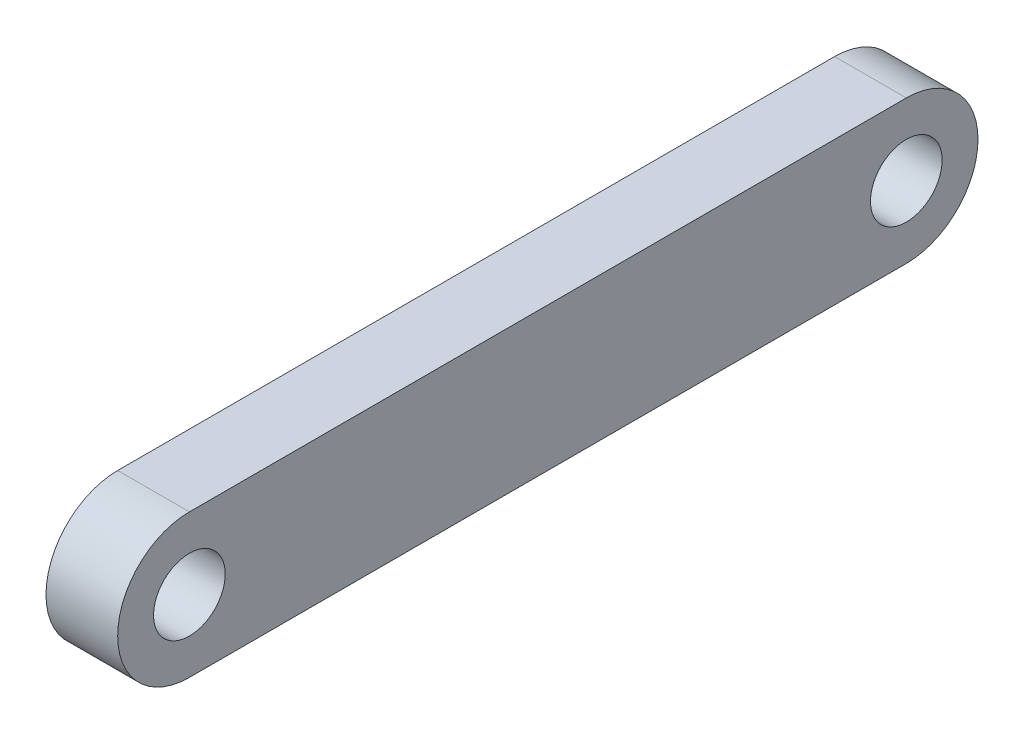
ISO-10303-21;
HEADER;
FILE_DESCRIPTION(('STEP AP214'),'2;1');
FILE_NAME('part.step','',(''),(''),'','','');
FILE_SCHEMA(('AUTOMOTIVE_DESIGN { 1 0 10303 214 1 1 1 1 }'));
ENDSEC;
DATA;
#1=APPLICATION_CONTEXT('core data for automotive mechanical design processes');
#2=APPLICATION_PROTOCOL_DEFINITION('international standard','automotive_design',2000,#1);
#3=PRODUCT_CONTEXT('',#1,'mechanical');
#4=PRODUCT('Part','Part','',(#3));
#5=PRODUCT_RELATED_PRODUCT_CATEGORY('part','',(#4));
#6=PRODUCT_DEFINITION_FORMATION('','',#4);
#7=PRODUCT_DEFINITION_CONTEXT('part definition',#1,'design');
#8=PRODUCT_DEFINITION('design','',#6,#7);
#9=PRODUCT_DEFINITION_SHAPE('','',#8);
#10=(LENGTH_UNIT() NAMED_UNIT(*) SI_UNIT(.MILLI.,.METRE.));
#11=(NAMED_UNIT(*) PLANE_ANGLE_UNIT() SI_UNIT($,.RADIAN.));
#12=(NAMED_UNIT(*) SI_UNIT($,.STERADIAN.) SOLID_ANGLE_UNIT());
#13=UNCERTAINTY_MEASURE_WITH_UNIT(LENGTH_MEASURE(1.E-05),#10,'distance_accuracy_value','');
#14=(GEOMETRIC_REPRESENTATION_CONTEXT(3) GLOBAL_UNCERTAINTY_ASSIGNED_CONTEXT((#13)) GLOBAL_UNIT_ASSIGNED_CONTEXT((#10,
#11,#12)) REPRESENTATION_CONTEXT('',''));
#15=CARTESIAN_POINT('',(0.,0.,0.));
#16=DIRECTION('',(0.,0.,1.));
#17=DIRECTION('',(1.,0.,0.));
#18=AXIS2_PLACEMENT_3D('',#15,#16,#17);
#19=CARTESIAN_POINT('',(8.,-7.99999999999999,0.));
#20=DIRECTION('',(0.,1.,0.));
#21=DIRECTION('',(0.,0.,1.));
#22=AXIS2_PLACEMENT_3D('',#19,#20,#21);
#23=PLANE('',#22);
#24=DIRECTION('',(0.,0.,-1.));
#25=VECTOR('',#24,1.);
#26=CARTESIAN_POINT('',(0.,-7.99999999999999,0.));
#27=LINE('',#26,#25);
#28=CARTESIAN_POINT('',(0.,-7.99999999999999,40.));
#29=VERTEX_POINT('',#28);
#30=CARTESIAN_POINT('',(0.,-7.99999999999999,-40.));
#31=VERTEX_POINT('',#30);
#32=EDGE_CURVE('E106',#29,#31,#27,.T.);
#33=ORIENTED_EDGE('',*,*,#32,.T.);
#34=DIRECTION('',(-1.,0.,0.));
#35=VECTOR('',#34,1.);
#36=CARTESIAN_POINT('',(8.,-7.99999999999999,-40.));
#37=LINE('',#36,#35);
#38=CARTESIAN_POINT('',(8.,-7.99999999999999,-40.));
#39=VERTEX_POINT('',#38);
#40=EDGE_CURVE('E11',#39,#31,#37,.T.);
#41=ORIENTED_EDGE('',*,*,#40,.F.);
#42=DIRECTION('',(0.,0.,-1.));
#43=VECTOR('',#42,1.);
#44=CARTESIAN_POINT('',(8.,-7.99999999999999,0.));
#45=LINE('',#44,#43);
#46=CARTESIAN_POINT('',(8.,-7.99999999999999,40.));
#47=VERTEX_POINT('',#46);
#48=EDGE_CURVE('E86',#47,#39,#45,.T.);
#49=ORIENTED_EDGE('',*,*,#48,.F.);
#50=DIRECTION('',(-1.,0.,0.));
#51=VECTOR('',#50,1.);
#52=CARTESIAN_POINT('',(8.,-7.99999999999999,40.));
#53=LINE('',#52,#51);
#54=EDGE_CURVE('E53',#47,#29,#53,.T.);
#55=ORIENTED_EDGE('',*,*,#54,.T.);
#56=EDGE_LOOP('',(#33,#41,#49,#55));
#57=FACE_BOUND('',#56,.T.);
#58=ADVANCED_FACE('F36',(#57),#23,.F.);
#59=CARTESIAN_POINT('',(8.,0.,-40.));
#60=DIRECTION('',(-1.,0.,0.));
#61=DIRECTION('',(0.,0.,1.));
#62=AXIS2_PLACEMENT_3D('',#59,#60,#61);
#63=CYLINDRICAL_SURFACE('',#62,7.99999999999999);
#64=CARTESIAN_POINT('',(0.,0.,-40.));
#65=DIRECTION('',(1.,0.,0.));
#66=DIRECTION('',(0.,0.,-1.));
#67=AXIS2_PLACEMENT_3D('',#64,#65,#66);
#68=CIRCLE('',#67,7.99999999999999);
#69=CARTESIAN_POINT('',(0.,7.99999999999998,-40.));
#70=VERTEX_POINT('',#69);
#71=EDGE_CURVE('E91',#31,#70,#68,.T.);
#72=ORIENTED_EDGE('',*,*,#71,.T.);
#73=DIRECTION('',(-1.,0.,0.));
#74=VECTOR('',#73,1.);
#75=CARTESIAN_POINT('',(8.,7.99999999999998,-40.));
#76=LINE('',#75,#74);
#77=CARTESIAN_POINT('',(8.,7.99999999999998,-40.));
#78=VERTEX_POINT('',#77);
#79=EDGE_CURVE('E45',#78,#70,#76,.T.);
#80=ORIENTED_EDGE('',*,*,#79,.F.);
#81=CARTESIAN_POINT('',(8.,0.,-40.));
#82=DIRECTION('',(1.,0.,0.));
#83=DIRECTION('',(0.,0.,-1.));
#84=AXIS2_PLACEMENT_3D('',#81,#82,#83);
#85=CIRCLE('',#84,7.99999999999999);
#86=EDGE_CURVE('E78',#39,#78,#85,.T.);
#87=ORIENTED_EDGE('',*,*,#86,.F.);
#88=ORIENTED_EDGE('',*,*,#40,.T.);
#89=EDGE_LOOP('',(#72,#80,#87,#88));
#90=FACE_BOUND('',#89,.T.);
#91=ADVANCED_FACE('F90',(#90),#63,.T.);
#92=CARTESIAN_POINT('',(8.,7.99999999999998,0.));
#93=DIRECTION('',(0.,1.,0.));
#94=DIRECTION('',(0.,0.,1.));
#95=AXIS2_PLACEMENT_3D('',#92,#93,#94);
#96=PLANE('',#95);
#97=DIRECTION('',(0.,0.,-1.));
#98=VECTOR('',#97,1.);
#99=CARTESIAN_POINT('',(0.,7.99999999999998,0.));
#100=LINE('',#99,#98);
#101=CARTESIAN_POINT('',(0.,7.99999999999998,40.));
#102=VERTEX_POINT('',#101);
#103=EDGE_CURVE('E109',#102,#70,#100,.T.);
#104=ORIENTED_EDGE('',*,*,#103,.F.);
#105=DIRECTION('',(-1.,0.,0.));
#106=VECTOR('',#105,1.);
#107=CARTESIAN_POINT('',(8.,7.99999999999998,40.));
#108=LINE('',#107,#106);
#109=CARTESIAN_POINT('',(8.,7.99999999999998,40.));
#110=VERTEX_POINT('',#109);
#111=EDGE_CURVE('E67',#110,#102,#108,.T.);
#112=ORIENTED_EDGE('',*,*,#111,.F.);
#113=DIRECTION('',(0.,0.,-1.));
#114=VECTOR('',#113,1.);
#115=CARTESIAN_POINT('',(8.,7.99999999999998,0.));
#116=LINE('',#115,#114);
#117=EDGE_CURVE('E85',#110,#78,#116,.T.);
#118=ORIENTED_EDGE('',*,*,#117,.T.);
#119=ORIENTED_EDGE('',*,*,#79,.T.);
#120=EDGE_LOOP('',(#104,#112,#118,#119));
#121=FACE_BOUND('',#120,.T.);
#122=ADVANCED_FACE('F94',(#121),#96,.T.);
#123=CARTESIAN_POINT('',(8.,0.,40.));
#124=DIRECTION('',(-1.,0.,0.));
#125=DIRECTION('',(0.,0.,1.));
#126=AXIS2_PLACEMENT_3D('',#123,#124,#125);
#127=CYLINDRICAL_SURFACE('',#126,4.00000000000001);
#128=CARTESIAN_POINT('',(8.,0.,40.));
#129=DIRECTION('',(1.,0.,0.));
#130=DIRECTION('',(0.,0.,-1.));
#131=AXIS2_PLACEMENT_3D('',#128,#129,#130);
#132=CIRCLE('',#131,4.00000000000001);
#133=CARTESIAN_POINT('',(8.,0.,36.));
#134=VERTEX_POINT('',#133);
#135=EDGE_CURVE('E118',#134,#134,#132,.T.);
#136=ORIENTED_EDGE('',*,*,#135,.T.);
#137=EDGE_LOOP('',(#136));
#138=FACE_BOUND('',#137,.T.);
#139=CARTESIAN_POINT('',(0.,0.,40.));
#140=DIRECTION('',(1.,0.,0.));
#141=DIRECTION('',(0.,0.,-1.));
#142=AXIS2_PLACEMENT_3D('',#139,#140,#141);
#143=CIRCLE('',#142,4.00000000000001);
#144=CARTESIAN_POINT('',(0.,0.,36.));
#145=VERTEX_POINT('',#144);
#146=EDGE_CURVE('E103',#145,#145,#143,.T.);
#147=ORIENTED_EDGE('',*,*,#146,.F.);
#148=EDGE_LOOP('',(#147));
#149=FACE_BOUND('',#148,.T.);
#150=ADVANCED_FACE('F126',(#138,#149),#127,.F.);
#151=CARTESIAN_POINT('',(8.,0.,-40.));
#152=DIRECTION('',(-1.,0.,0.));
#153=DIRECTION('',(0.,0.,1.));
#154=AXIS2_PLACEMENT_3D('',#151,#152,#153);
#155=CYLINDRICAL_SURFACE('',#154,4.00000000000001);
#156=CARTESIAN_POINT('',(8.,0.,-40.));
#157=DIRECTION('',(1.,0.,0.));
#158=DIRECTION('',(0.,0.,-1.));
#159=AXIS2_PLACEMENT_3D('',#156,#157,#158);
#160=CIRCLE('',#159,4.00000000000001);
#161=CARTESIAN_POINT('',(8.,0.,-44.));
#162=VERTEX_POINT('',#161);
#163=EDGE_CURVE('E114',#162,#162,#160,.F.);
#164=ORIENTED_EDGE('',*,*,#163,.F.);
#165=EDGE_LOOP('',(#164));
#166=FACE_BOUND('',#165,.T.);
#167=CARTESIAN_POINT('',(0.,0.,-40.));
#168=DIRECTION('',(1.,0.,0.));
#169=DIRECTION('',(0.,0.,-1.));
#170=AXIS2_PLACEMENT_3D('',#167,#168,#169);
#171=CIRCLE('',#170,4.00000000000001);
#172=CARTESIAN_POINT('',(0.,0.,-44.));
#173=VERTEX_POINT('',#172);
#174=EDGE_CURVE('E100',#173,#173,#171,.F.);
#175=ORIENTED_EDGE('',*,*,#174,.T.);
#176=EDGE_LOOP('',(#175));
#177=FACE_BOUND('',#176,.T.);
#178=ADVANCED_FACE('F38',(#166,#177),#155,.F.);
#179=CARTESIAN_POINT('',(8.,0.,40.));
#180=DIRECTION('',(-1.,0.,0.));
#181=DIRECTION('',(0.,0.,1.));
#182=AXIS2_PLACEMENT_3D('',#179,#180,#181);
#183=CYLINDRICAL_SURFACE('',#182,7.99999999999999);
#184=CARTESIAN_POINT('',(0.,0.,40.));
#185=DIRECTION('',(1.,0.,0.));
#186=DIRECTION('',(0.,0.,-1.));
#187=AXIS2_PLACEMENT_3D('',#184,#185,#186);
#188=CIRCLE('',#187,7.99999999999999);
#189=EDGE_CURVE('E111',#29,#102,#188,.F.);
#190=ORIENTED_EDGE('',*,*,#189,.F.);
#191=ORIENTED_EDGE('',*,*,#54,.F.);
#192=CARTESIAN_POINT('',(8.,0.,40.));
#193=DIRECTION('',(1.,0.,0.));
#194=DIRECTION('',(0.,0.,-1.));
#195=AXIS2_PLACEMENT_3D('',#192,#193,#194);
#196=CIRCLE('',#195,7.99999999999999);
#197=EDGE_CURVE('E95',#47,#110,#196,.F.);
#198=ORIENTED_EDGE('',*,*,#197,.T.);
#199=ORIENTED_EDGE('',*,*,#111,.T.);
#200=EDGE_LOOP('',(#190,#191,#198,#199));
#201=FACE_BOUND('',#200,.T.);
#202=ADVANCED_FACE('F131',(#201),#183,.T.);
#203=CARTESIAN_POINT('',(8.,0.,0.));
#204=DIRECTION('',(1.,0.,0.));
#205=DIRECTION('',(0.,0.,-1.));
#206=AXIS2_PLACEMENT_3D('',#203,#204,#205);
#207=PLANE('',#206);
#208=ORIENTED_EDGE('',*,*,#163,.T.);
#209=EDGE_LOOP('',(#208));
#210=FACE_BOUND('',#209,.T.);
#211=ORIENTED_EDGE('',*,*,#135,.F.);
#212=EDGE_LOOP('',(#211));
#213=FACE_BOUND('',#212,.T.);
#214=ORIENTED_EDGE('',*,*,#48,.T.);
#215=ORIENTED_EDGE('',*,*,#86,.T.);
#216=ORIENTED_EDGE('',*,*,#117,.F.);
#217=ORIENTED_EDGE('',*,*,#197,.F.);
#218=EDGE_LOOP('',(#214,#215,#216,#217));
#219=FACE_BOUND('',#218,.T.);
#220=ADVANCED_FACE('F82',(#210,#213,#219),#207,.T.);
#221=CARTESIAN_POINT('',(0.,0.,0.));
#222=DIRECTION('',(1.,0.,0.));
#223=DIRECTION('',(0.,0.,-1.));
#224=AXIS2_PLACEMENT_3D('',#221,#222,#223);
#225=PLANE('',#224);
#226=ORIENTED_EDGE('',*,*,#174,.F.);
#227=EDGE_LOOP('',(#226));
#228=FACE_BOUND('',#227,.T.);
#229=ORIENTED_EDGE('',*,*,#146,.T.);
#230=EDGE_LOOP('',(#229));
#231=FACE_BOUND('',#230,.T.);
#232=ORIENTED_EDGE('',*,*,#32,.F.);
#233=ORIENTED_EDGE('',*,*,#189,.T.);
#234=ORIENTED_EDGE('',*,*,#103,.T.);
#235=ORIENTED_EDGE('',*,*,#71,.F.);
#236=EDGE_LOOP('',(#232,#233,#234,#235));
#237=FACE_BOUND('',#236,.T.);
#238=ADVANCED_FACE('F130',(#228,#231,#237),#225,.F.);
#239=CLOSED_SHELL('',(#58,#91,#122,#150,#178,#202,#220,#238));
#240=MANIFOLD_SOLID_BREP('B2',#239);
#241=ADVANCED_BREP_SHAPE_REPRESENTATION('',(#18,#240),#14);
#242=SHAPE_DEFINITION_REPRESENTATION(#9,#241);
ENDSEC;
END-ISO-10303-21;
